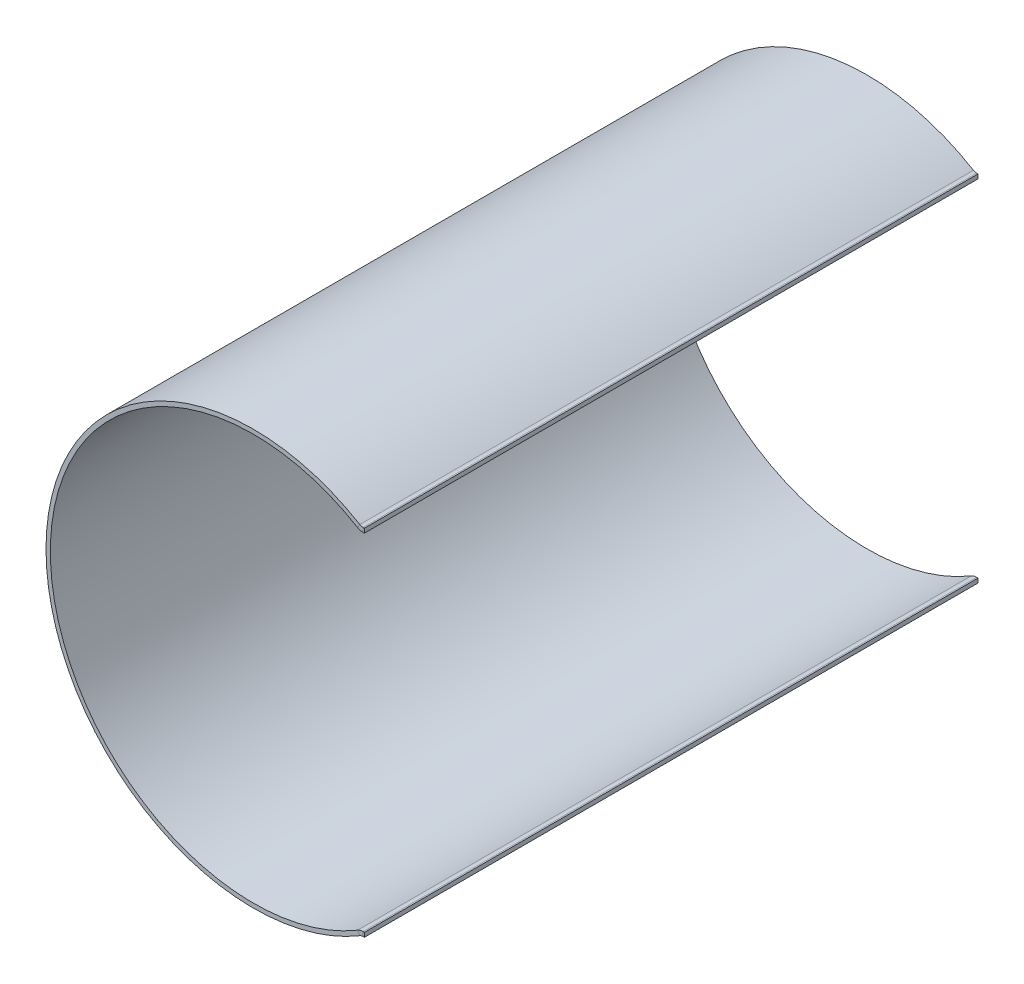
ISO-10303-21;
HEADER;
FILE_DESCRIPTION(('STEP AP214'),'2;1');
FILE_NAME('part.step','',(''),(''),'','','');
FILE_SCHEMA(('AUTOMOTIVE_DESIGN { 1 0 10303 214 1 1 1 1 }'));
ENDSEC;
DATA;
#1=APPLICATION_CONTEXT('core data for automotive mechanical design processes');
#2=APPLICATION_PROTOCOL_DEFINITION('international standard','automotive_design',2000,#1);
#3=PRODUCT_CONTEXT('',#1,'mechanical');
#4=PRODUCT('Part','Part','',(#3));
#5=PRODUCT_RELATED_PRODUCT_CATEGORY('part','',(#4));
#6=PRODUCT_DEFINITION_FORMATION('','',#4);
#7=PRODUCT_DEFINITION_CONTEXT('part definition',#1,'design');
#8=PRODUCT_DEFINITION('design','',#6,#7);
#9=PRODUCT_DEFINITION_SHAPE('','',#8);
#10=(LENGTH_UNIT() NAMED_UNIT(*) SI_UNIT(.MILLI.,.METRE.));
#11=(NAMED_UNIT(*) PLANE_ANGLE_UNIT() SI_UNIT($,.RADIAN.));
#12=(NAMED_UNIT(*) SI_UNIT($,.STERADIAN.) SOLID_ANGLE_UNIT());
#13=UNCERTAINTY_MEASURE_WITH_UNIT(LENGTH_MEASURE(1.E-05),#10,'distance_accuracy_value','');
#14=(GEOMETRIC_REPRESENTATION_CONTEXT(3) GLOBAL_UNCERTAINTY_ASSIGNED_CONTEXT((#13)) GLOBAL_UNIT_ASSIGNED_CONTEXT((#10,
#11,#12)) REPRESENTATION_CONTEXT('',''));
#15=CARTESIAN_POINT('',(0.,0.,0.));
#16=DIRECTION('',(0.,0.,1.));
#17=DIRECTION('',(1.,0.,0.));
#18=AXIS2_PLACEMENT_3D('',#15,#16,#17);
#19=CARTESIAN_POINT('',(12.0507546694725,20.1749674571283,35.5));
#20=DIRECTION('',(0.,0.,1.));
#21=DIRECTION('',(1.,0.,0.));
#22=AXIS2_PLACEMENT_3D('',#19,#20,#21);
#23=PLANE('',#22);
#24=DIRECTION('',(0.512798071041383,0.858509253494822,0.));
#25=VECTOR('',#24,1.);
#26=CARTESIAN_POINT('',(12.0507546694725,20.1749674571283,35.5));
#27=LINE('',#26,#25);
#28=CARTESIAN_POINT('',(12.0507546694725,20.1749674571283,35.5));
#29=VERTEX_POINT('',#28);
#30=CARTESIAN_POINT('',(12.3071537049932,20.6042220838757,35.5));
#31=VERTEX_POINT('',#30);
#32=EDGE_CURVE('E11',#29,#31,#27,.T.);
#33=ORIENTED_EDGE('',*,*,#32,.F.);
#34=CARTESIAN_POINT('',(12.6848807641223,21.2366,35.5));
#35=DIRECTION('',(0.,0.,1.));
#36=DIRECTION('',(1.,0.,0.));
#37=AXIS2_PLACEMENT_3D('',#34,#35,#36);
#38=CIRCLE('',#37,1.2366);
#39=CARTESIAN_POINT('',(12.6848807641223,20.,35.5));
#40=VERTEX_POINT('',#39);
#41=EDGE_CURVE('E251',#40,#29,#38,.F.);
#42=ORIENTED_EDGE('',*,*,#41,.F.);
#43=DIRECTION('',(0.,-1.,0.));
#44=VECTOR('',#43,1.);
#45=CARTESIAN_POINT('',(12.6848807641223,20.5,35.5));
#46=LINE('',#45,#44);
#47=CARTESIAN_POINT('',(12.6848807641223,20.5,35.5));
#48=VERTEX_POINT('',#47);
#49=EDGE_CURVE('E49',#48,#40,#46,.T.);
#50=ORIENTED_EDGE('',*,*,#49,.F.);
#51=CARTESIAN_POINT('',(12.6848807641223,21.2366,35.5));
#52=DIRECTION('',(0.,0.,1.));
#53=DIRECTION('',(1.,0.,0.));
#54=AXIS2_PLACEMENT_3D('',#51,#52,#53);
#55=CIRCLE('',#54,0.7366);
#56=EDGE_CURVE('E150',#48,#31,#55,.F.);
#57=ORIENTED_EDGE('',*,*,#56,.T.);
#58=EDGE_LOOP('',(#33,#42,#50,#57));
#59=FACE_BOUND('',#58,.T.);
#60=ADVANCED_FACE('F41',(#59),#23,.T.);
#61=CARTESIAN_POINT('',(12.6848807641223,20.5,35.5));
#62=DIRECTION('',(0.,0.,1.));
#63=DIRECTION('',(1.,0.,0.));
#64=AXIS2_PLACEMENT_3D('',#61,#62,#63);
#65=PLANE('',#64);
#66=CARTESIAN_POINT('',(0.,0.,35.5));
#67=DIRECTION('',(0.,0.,1.));
#68=DIRECTION('',(-1.,0.,0.));
#69=AXIS2_PLACEMENT_3D('',#66,#67,#68);
#70=CIRCLE('',#69,23.5);
#71=CARTESIAN_POINT('',(12.0507546694725,-20.1749674571283,35.5));
#72=VERTEX_POINT('',#71);
#73=EDGE_CURVE('E144',#29,#72,#70,.T.);
#74=ORIENTED_EDGE('',*,*,#73,.F.);
#75=ORIENTED_EDGE('',*,*,#32,.T.);
#76=CARTESIAN_POINT('',(0.,0.,35.5));
#77=DIRECTION('',(0.,0.,1.));
#78=DIRECTION('',(1.,0.,0.));
#79=AXIS2_PLACEMENT_3D('',#76,#77,#78);
#80=CIRCLE('',#79,24.);
#81=CARTESIAN_POINT('',(12.3071537049932,-20.6042220838757,35.5));
#82=VERTEX_POINT('',#81);
#83=EDGE_CURVE('E141',#31,#82,#80,.T.);
#84=ORIENTED_EDGE('',*,*,#83,.T.);
#85=DIRECTION('',(-0.512798071041383,0.858509253494822,0.));
#86=VECTOR('',#85,1.);
#87=CARTESIAN_POINT('',(12.3071537049932,-20.6042220838757,35.5));
#88=LINE('',#87,#86);
#89=EDGE_CURVE('E232',#82,#72,#88,.T.);
#90=ORIENTED_EDGE('',*,*,#89,.T.);
#91=EDGE_LOOP('',(#74,#75,#84,#90));
#92=FACE_BOUND('',#91,.T.);
#93=ADVANCED_FACE('F139',(#92),#65,.T.);
#94=CARTESIAN_POINT('',(12.6848807641223,20.,-35.5));
#95=DIRECTION('',(0.,0.,-1.));
#96=DIRECTION('',(-1.,0.,0.));
#97=AXIS2_PLACEMENT_3D('',#94,#95,#96);
#98=PLANE('',#97);
#99=DIRECTION('',(0.,1.,0.));
#100=VECTOR('',#99,1.);
#101=CARTESIAN_POINT('',(12.6848807641223,20.,-35.5));
#102=LINE('',#101,#100);
#103=CARTESIAN_POINT('',(12.6848807641223,20.,-35.5));
#104=VERTEX_POINT('',#103);
#105=CARTESIAN_POINT('',(12.6848807641223,20.5,-35.5));
#106=VERTEX_POINT('',#105);
#107=EDGE_CURVE('E237',#104,#106,#102,.T.);
#108=ORIENTED_EDGE('',*,*,#107,.F.);
#109=CARTESIAN_POINT('',(12.6848807641223,21.2366,-35.5));
#110=DIRECTION('',(0.,0.,1.));
#111=DIRECTION('',(1.,0.,0.));
#112=AXIS2_PLACEMENT_3D('',#109,#110,#111);
#113=CIRCLE('',#112,1.2366);
#114=CARTESIAN_POINT('',(12.0507546694725,20.1749674571283,-35.5));
#115=VERTEX_POINT('',#114);
#116=EDGE_CURVE('E189',#104,#115,#113,.F.);
#117=ORIENTED_EDGE('',*,*,#116,.T.);
#118=DIRECTION('',(-0.512798071041383,-0.858509253494822,0.));
#119=VECTOR('',#118,1.);
#120=CARTESIAN_POINT('',(12.3071537049932,20.6042220838757,-35.5));
#121=LINE('',#120,#119);
#122=CARTESIAN_POINT('',(12.3071537049932,20.6042220838757,-35.5));
#123=VERTEX_POINT('',#122);
#124=EDGE_CURVE('E235',#123,#115,#121,.T.);
#125=ORIENTED_EDGE('',*,*,#124,.F.);
#126=CARTESIAN_POINT('',(12.6848807641223,21.2366,-35.5));
#127=DIRECTION('',(0.,0.,1.));
#128=DIRECTION('',(1.,0.,0.));
#129=AXIS2_PLACEMENT_3D('',#126,#127,#128);
#130=CIRCLE('',#129,0.7366);
#131=EDGE_CURVE('E162',#106,#123,#130,.F.);
#132=ORIENTED_EDGE('',*,*,#131,.F.);
#133=EDGE_LOOP('',(#108,#117,#125,#132));
#134=FACE_BOUND('',#133,.T.);
#135=ADVANCED_FACE('F289',(#134),#98,.T.);
#136=CARTESIAN_POINT('',(12.3071537049932,20.6042220838757,-35.5));
#137=DIRECTION('',(0.,0.,-1.));
#138=DIRECTION('',(-1.,0.,0.));
#139=AXIS2_PLACEMENT_3D('',#136,#137,#138);
#140=PLANE('',#139);
#141=DIRECTION('',(-1.,0.,0.));
#142=VECTOR('',#141,1.);
#143=CARTESIAN_POINT('',(12.3389626792531,20.,-35.5));
#144=LINE('',#143,#142);
#145=CARTESIAN_POINT('',(12.8389626792531,20.,-35.5));
#146=VERTEX_POINT('',#145);
#147=EDGE_CURVE('E192',#146,#104,#144,.T.);
#148=ORIENTED_EDGE('',*,*,#147,.T.);
#149=ORIENTED_EDGE('',*,*,#107,.T.);
#150=DIRECTION('',(1.,0.,0.));
#151=VECTOR('',#150,1.);
#152=CARTESIAN_POINT('',(12.3389626792531,20.5,-35.5));
#153=LINE('',#152,#151);
#154=CARTESIAN_POINT('',(12.8389626792531,20.5,-35.5));
#155=VERTEX_POINT('',#154);
#156=EDGE_CURVE('E198',#155,#106,#153,.F.);
#157=ORIENTED_EDGE('',*,*,#156,.F.);
#158=DIRECTION('',(0.,-1.,0.));
#159=VECTOR('',#158,1.);
#160=CARTESIAN_POINT('',(12.8389626792531,20.5,-35.5));
#161=LINE('',#160,#159);
#162=EDGE_CURVE('E195',#155,#146,#161,.T.);
#163=ORIENTED_EDGE('',*,*,#162,.T.);
#164=EDGE_LOOP('',(#148,#149,#157,#163));
#165=FACE_BOUND('',#164,.T.);
#166=ADVANCED_FACE('F292',(#165),#140,.T.);
#167=CARTESIAN_POINT('',(12.6848807641223,-20.,35.5));
#168=DIRECTION('',(0.,0.,1.));
#169=DIRECTION('',(1.,0.,0.));
#170=AXIS2_PLACEMENT_3D('',#167,#168,#169);
#171=PLANE('',#170);
#172=DIRECTION('',(0.,-1.,0.));
#173=VECTOR('',#172,1.);
#174=CARTESIAN_POINT('',(12.6848807641223,-20.,35.5));
#175=LINE('',#174,#173);
#176=CARTESIAN_POINT('',(12.6848807641223,-20.,35.5));
#177=VERTEX_POINT('',#176);
#178=CARTESIAN_POINT('',(12.6848807641223,-20.5,35.5));
#179=VERTEX_POINT('',#178);
#180=EDGE_CURVE('E57',#177,#179,#175,.T.);
#181=ORIENTED_EDGE('',*,*,#180,.F.);
#182=CARTESIAN_POINT('',(12.6848807641223,-21.2366,35.5));
#183=DIRECTION('',(0.,0.,1.));
#184=DIRECTION('',(1.,0.,0.));
#185=AXIS2_PLACEMENT_3D('',#182,#183,#184);
#186=CIRCLE('',#185,1.2366);
#187=EDGE_CURVE('E261',#72,#177,#186,.F.);
#188=ORIENTED_EDGE('',*,*,#187,.F.);
#189=ORIENTED_EDGE('',*,*,#89,.F.);
#190=CARTESIAN_POINT('',(12.6848807641223,-21.2366,35.5));
#191=DIRECTION('',(0.,0.,1.));
#192=DIRECTION('',(1.,0.,0.));
#193=AXIS2_PLACEMENT_3D('',#190,#191,#192);
#194=CIRCLE('',#193,0.7366);
#195=EDGE_CURVE('E170',#82,#179,#194,.F.);
#196=ORIENTED_EDGE('',*,*,#195,.T.);
#197=EDGE_LOOP('',(#181,#188,#189,#196));
#198=FACE_BOUND('',#197,.T.);
#199=ADVANCED_FACE('F284',(#198),#171,.T.);
#200=CARTESIAN_POINT('',(12.3071537049932,-20.6042220838757,35.5));
#201=DIRECTION('',(0.,0.,1.));
#202=DIRECTION('',(1.,0.,0.));
#203=AXIS2_PLACEMENT_3D('',#200,#201,#202);
#204=PLANE('',#203);
#205=DIRECTION('',(1.,0.,0.));
#206=VECTOR('',#205,1.);
#207=CARTESIAN_POINT('',(12.3389626792531,-20.,35.5));
#208=LINE('',#207,#206);
#209=CARTESIAN_POINT('',(12.8389626792531,-20.,35.5));
#210=VERTEX_POINT('',#209);
#211=EDGE_CURVE('E264',#177,#210,#208,.T.);
#212=ORIENTED_EDGE('',*,*,#211,.F.);
#213=ORIENTED_EDGE('',*,*,#180,.T.);
#214=DIRECTION('',(1.,0.,0.));
#215=VECTOR('',#214,1.);
#216=CARTESIAN_POINT('',(12.3389626792531,-20.5,35.5));
#217=LINE('',#216,#215);
#218=CARTESIAN_POINT('',(12.838962679253,-20.5,35.5));
#219=VERTEX_POINT('',#218);
#220=EDGE_CURVE('E111',#179,#219,#217,.T.);
#221=ORIENTED_EDGE('',*,*,#220,.T.);
#222=DIRECTION('',(0.,-1.,0.));
#223=VECTOR('',#222,1.);
#224=CARTESIAN_POINT('',(12.8389626792531,-20.,35.5));
#225=LINE('',#224,#223);
#226=EDGE_CURVE('E267',#210,#219,#225,.T.);
#227=ORIENTED_EDGE('',*,*,#226,.F.);
#228=EDGE_LOOP('',(#212,#213,#221,#227));
#229=FACE_BOUND('',#228,.T.);
#230=ADVANCED_FACE('F273',(#229),#204,.T.);
#231=CARTESIAN_POINT('',(12.0507546694725,-20.1749674571283,-35.5));
#232=DIRECTION('',(0.,0.,-1.));
#233=DIRECTION('',(-1.,0.,0.));
#234=AXIS2_PLACEMENT_3D('',#231,#232,#233);
#235=PLANE('',#234);
#236=DIRECTION('',(0.512798071041383,-0.858509253494822,0.));
#237=VECTOR('',#236,1.);
#238=CARTESIAN_POINT('',(12.0507546694725,-20.1749674571283,-35.5));
#239=LINE('',#238,#237);
#240=CARTESIAN_POINT('',(12.0507546694725,-20.1749674571283,-35.5));
#241=VERTEX_POINT('',#240);
#242=CARTESIAN_POINT('',(12.3071537049932,-20.6042220838757,-35.5));
#243=VERTEX_POINT('',#242);
#244=EDGE_CURVE('E98',#241,#243,#239,.T.);
#245=ORIENTED_EDGE('',*,*,#244,.F.);
#246=CARTESIAN_POINT('',(12.6848807641223,-21.2366,-35.5));
#247=DIRECTION('',(0.,0.,1.));
#248=DIRECTION('',(1.,0.,0.));
#249=AXIS2_PLACEMENT_3D('',#246,#247,#248);
#250=CIRCLE('',#249,1.2366);
#251=CARTESIAN_POINT('',(12.6848807641223,-20.,-35.5));
#252=VERTEX_POINT('',#251);
#253=EDGE_CURVE('E185',#241,#252,#250,.F.);
#254=ORIENTED_EDGE('',*,*,#253,.T.);
#255=DIRECTION('',(0.,1.,0.));
#256=VECTOR('',#255,1.);
#257=CARTESIAN_POINT('',(12.6848807641223,-20.5,-35.5));
#258=LINE('',#257,#256);
#259=CARTESIAN_POINT('',(12.6848807641223,-20.5,-35.5));
#260=VERTEX_POINT('',#259);
#261=EDGE_CURVE('E105',#260,#252,#258,.T.);
#262=ORIENTED_EDGE('',*,*,#261,.F.);
#263=CARTESIAN_POINT('',(12.6848807641223,-21.2366,-35.5));
#264=DIRECTION('',(0.,0.,1.));
#265=DIRECTION('',(1.,0.,0.));
#266=AXIS2_PLACEMENT_3D('',#263,#264,#265);
#267=CIRCLE('',#266,0.7366);
#268=EDGE_CURVE('E204',#243,#260,#267,.F.);
#269=ORIENTED_EDGE('',*,*,#268,.F.);
#270=EDGE_LOOP('',(#245,#254,#262,#269));
#271=FACE_BOUND('',#270,.T.);
#272=ADVANCED_FACE('F321',(#271),#235,.T.);
#273=CARTESIAN_POINT('',(12.6848807641223,-20.5,-35.5));
#274=DIRECTION('',(0.,0.,-1.));
#275=DIRECTION('',(-1.,0.,0.));
#276=AXIS2_PLACEMENT_3D('',#273,#274,#275);
#277=PLANE('',#276);
#278=CARTESIAN_POINT('',(0.,0.,-35.5));
#279=DIRECTION('',(0.,0.,1.));
#280=DIRECTION('',(-1.,0.,0.));
#281=AXIS2_PLACEMENT_3D('',#278,#279,#280);
#282=CIRCLE('',#281,23.5);
#283=EDGE_CURVE('E187',#115,#241,#282,.T.);
#284=ORIENTED_EDGE('',*,*,#283,.T.);
#285=ORIENTED_EDGE('',*,*,#244,.T.);
#286=CARTESIAN_POINT('',(0.,0.,-35.5));
#287=DIRECTION('',(0.,0.,1.));
#288=DIRECTION('',(1.,0.,0.));
#289=AXIS2_PLACEMENT_3D('',#286,#287,#288);
#290=CIRCLE('',#289,24.);
#291=EDGE_CURVE('E202',#123,#243,#290,.T.);
#292=ORIENTED_EDGE('',*,*,#291,.F.);
#293=ORIENTED_EDGE('',*,*,#124,.T.);
#294=EDGE_LOOP('',(#284,#285,#292,#293));
#295=FACE_BOUND('',#294,.T.);
#296=ADVANCED_FACE('F324',(#295),#277,.T.);
#297=CARTESIAN_POINT('',(12.3389626792531,-20.5,35.5));
#298=DIRECTION('',(0.,1.,0.));
#299=DIRECTION('',(-1.,0.,0.));
#300=AXIS2_PLACEMENT_3D('',#297,#298,#299);
#301=PLANE('',#300);
#302=DIRECTION('',(1.,0.,0.));
#303=VECTOR('',#302,1.);
#304=CARTESIAN_POINT('',(12.3389626792531,-20.5,-35.5));
#305=LINE('',#304,#303);
#306=CARTESIAN_POINT('',(12.838962679253,-20.5,-35.5));
#307=VERTEX_POINT('',#306);
#308=EDGE_CURVE('E176',#260,#307,#305,.T.);
#309=ORIENTED_EDGE('',*,*,#308,.T.);
#310=DIRECTION('',(0.,0.,-1.));
#311=VECTOR('',#310,1.);
#312=CARTESIAN_POINT('',(12.838962679253,-20.5,35.5));
#313=LINE('',#312,#311);
#314=EDGE_CURVE('E228',#219,#307,#313,.T.);
#315=ORIENTED_EDGE('',*,*,#314,.F.);
#316=ORIENTED_EDGE('',*,*,#220,.F.);
#317=DIRECTION('',(0.,0.,-1.));
#318=VECTOR('',#317,1.);
#319=CARTESIAN_POINT('',(12.6848807641223,-20.5,35.5));
#320=LINE('',#319,#318);
#321=EDGE_CURVE('E172',#179,#260,#320,.T.);
#322=ORIENTED_EDGE('',*,*,#321,.T.);
#323=EDGE_LOOP('',(#309,#315,#316,#322));
#324=FACE_BOUND('',#323,.T.);
#325=ADVANCED_FACE('F327',(#324),#301,.F.);
#326=CARTESIAN_POINT('',(12.8389626792531,-20.,35.5));
#327=DIRECTION('',(1.,0.,0.));
#328=DIRECTION('',(0.,1.,0.));
#329=AXIS2_PLACEMENT_3D('',#326,#327,#328);
#330=PLANE('',#329);
#331=DIRECTION('',(0.,-1.,0.));
#332=VECTOR('',#331,1.);
#333=CARTESIAN_POINT('',(12.8389626792531,-20.,-35.5));
#334=LINE('',#333,#332);
#335=CARTESIAN_POINT('',(12.8389626792531,-20.,-35.5));
#336=VERTEX_POINT('',#335);
#337=EDGE_CURVE('E179',#336,#307,#334,.T.);
#338=ORIENTED_EDGE('',*,*,#337,.F.);
#339=DIRECTION('',(0.,0.,-1.));
#340=VECTOR('',#339,1.);
#341=CARTESIAN_POINT('',(12.8389626792531,-20.,35.5));
#342=LINE('',#341,#340);
#343=EDGE_CURVE('E226',#210,#336,#342,.T.);
#344=ORIENTED_EDGE('',*,*,#343,.F.);
#345=ORIENTED_EDGE('',*,*,#226,.T.);
#346=ORIENTED_EDGE('',*,*,#314,.T.);
#347=EDGE_LOOP('',(#338,#344,#345,#346));
#348=FACE_BOUND('',#347,.T.);
#349=ADVANCED_FACE('F272',(#348),#330,.T.);
#350=CARTESIAN_POINT('',(12.3389626792531,-20.,35.5));
#351=DIRECTION('',(0.,1.,0.));
#352=DIRECTION('',(-1.,0.,0.));
#353=AXIS2_PLACEMENT_3D('',#350,#351,#352);
#354=PLANE('',#353);
#355=DIRECTION('',(1.,0.,0.));
#356=VECTOR('',#355,1.);
#357=CARTESIAN_POINT('',(12.3389626792531,-20.,-35.5));
#358=LINE('',#357,#356);
#359=EDGE_CURVE('E182',#252,#336,#358,.T.);
#360=ORIENTED_EDGE('',*,*,#359,.F.);
#361=DIRECTION('',(0.,0.,-1.));
#362=VECTOR('',#361,1.);
#363=CARTESIAN_POINT('',(12.6848807641223,-20.,35.5));
#364=LINE('',#363,#362);
#365=EDGE_CURVE('E223',#177,#252,#364,.T.);
#366=ORIENTED_EDGE('',*,*,#365,.F.);
#367=ORIENTED_EDGE('',*,*,#211,.T.);
#368=ORIENTED_EDGE('',*,*,#343,.T.);
#369=EDGE_LOOP('',(#360,#366,#367,#368));
#370=FACE_BOUND('',#369,.T.);
#371=ADVANCED_FACE('F277',(#370),#354,.T.);
#372=CARTESIAN_POINT('',(12.6848807641223,-21.2366,35.5));
#373=DIRECTION('',(0.,0.,-1.));
#374=DIRECTION('',(-1.,0.,0.));
#375=AXIS2_PLACEMENT_3D('',#372,#373,#374);
#376=CYLINDRICAL_SURFACE('',#375,1.2366);
#377=ORIENTED_EDGE('',*,*,#253,.F.);
#378=DIRECTION('',(0.,0.,-1.));
#379=VECTOR('',#378,1.);
#380=CARTESIAN_POINT('',(12.0507546694725,-20.1749674571283,35.5));
#381=LINE('',#380,#379);
#382=EDGE_CURVE('E220',#72,#241,#381,.T.);
#383=ORIENTED_EDGE('',*,*,#382,.F.);
#384=ORIENTED_EDGE('',*,*,#187,.T.);
#385=ORIENTED_EDGE('',*,*,#365,.T.);
#386=EDGE_LOOP('',(#377,#383,#384,#385));
#387=FACE_BOUND('',#386,.T.);
#388=ADVANCED_FACE('F280',(#387),#376,.T.);
#389=CARTESIAN_POINT('',(0.,0.,35.5));
#390=DIRECTION('',(0.,0.,-1.));
#391=DIRECTION('',(-1.,0.,0.));
#392=AXIS2_PLACEMENT_3D('',#389,#390,#391);
#393=CYLINDRICAL_SURFACE('',#392,23.5);
#394=ORIENTED_EDGE('',*,*,#283,.F.);
#395=DIRECTION('',(0.,0.,-1.));
#396=VECTOR('',#395,1.);
#397=CARTESIAN_POINT('',(12.0507546694725,20.1749674571283,35.5));
#398=LINE('',#397,#396);
#399=EDGE_CURVE('E217',#29,#115,#398,.T.);
#400=ORIENTED_EDGE('',*,*,#399,.F.);
#401=ORIENTED_EDGE('',*,*,#73,.T.);
#402=ORIENTED_EDGE('',*,*,#382,.T.);
#403=EDGE_LOOP('',(#394,#400,#401,#402));
#404=FACE_BOUND('',#403,.T.);
#405=ADVANCED_FACE('F287',(#404),#393,.F.);
#406=CARTESIAN_POINT('',(12.6848807641223,21.2366,35.5));
#407=DIRECTION('',(0.,0.,-1.));
#408=DIRECTION('',(-1.,0.,0.));
#409=AXIS2_PLACEMENT_3D('',#406,#407,#408);
#410=CYLINDRICAL_SURFACE('',#409,1.2366);
#411=ORIENTED_EDGE('',*,*,#116,.F.);
#412=DIRECTION('',(0.,0.,-1.));
#413=VECTOR('',#412,1.);
#414=CARTESIAN_POINT('',(12.6848807641223,20.,35.5));
#415=LINE('',#414,#413);
#416=EDGE_CURVE('E214',#40,#104,#415,.T.);
#417=ORIENTED_EDGE('',*,*,#416,.F.);
#418=ORIENTED_EDGE('',*,*,#41,.T.);
#419=ORIENTED_EDGE('',*,*,#399,.T.);
#420=EDGE_LOOP('',(#411,#417,#418,#419));
#421=FACE_BOUND('',#420,.T.);
#422=ADVANCED_FACE('F250',(#421),#410,.T.);
#423=CARTESIAN_POINT('',(12.3389626792531,20.,35.5));
#424=DIRECTION('',(0.,-1.,0.));
#425=DIRECTION('',(0.,0.,-1.));
#426=AXIS2_PLACEMENT_3D('',#423,#424,#425);
#427=PLANE('',#426);
#428=ORIENTED_EDGE('',*,*,#147,.F.);
#429=DIRECTION('',(0.,0.,-1.));
#430=VECTOR('',#429,1.);
#431=CARTESIAN_POINT('',(12.8389626792531,20.,35.5));
#432=LINE('',#431,#430);
#433=CARTESIAN_POINT('',(12.8389626792531,20.,35.5));
#434=VERTEX_POINT('',#433);
#435=EDGE_CURVE('E212',#434,#146,#432,.T.);
#436=ORIENTED_EDGE('',*,*,#435,.F.);
#437=DIRECTION('',(-1.,0.,0.));
#438=VECTOR('',#437,1.);
#439=CARTESIAN_POINT('',(12.3389626792531,20.,35.5));
#440=LINE('',#439,#438);
#441=EDGE_CURVE('E244',#434,#40,#440,.T.);
#442=ORIENTED_EDGE('',*,*,#441,.T.);
#443=ORIENTED_EDGE('',*,*,#416,.T.);
#444=EDGE_LOOP('',(#428,#436,#442,#443));
#445=FACE_BOUND('',#444,.T.);
#446=ADVANCED_FACE('F255',(#445),#427,.T.);
#447=CARTESIAN_POINT('',(12.8389626792531,20.5,35.5));
#448=DIRECTION('',(1.,0.,0.));
#449=DIRECTION('',(0.,0.,-1.));
#450=AXIS2_PLACEMENT_3D('',#447,#448,#449);
#451=PLANE('',#450);
#452=ORIENTED_EDGE('',*,*,#162,.F.);
#453=DIRECTION('',(0.,0.,-1.));
#454=VECTOR('',#453,1.);
#455=CARTESIAN_POINT('',(12.8389626792531,20.5,35.5));
#456=LINE('',#455,#454);
#457=CARTESIAN_POINT('',(12.8389626792531,20.5,35.5));
#458=VERTEX_POINT('',#457);
#459=EDGE_CURVE('E210',#458,#155,#456,.T.);
#460=ORIENTED_EDGE('',*,*,#459,.F.);
#461=DIRECTION('',(0.,-1.,0.));
#462=VECTOR('',#461,1.);
#463=CARTESIAN_POINT('',(12.8389626792531,20.5,35.5));
#464=LINE('',#463,#462);
#465=EDGE_CURVE('E256',#458,#434,#464,.T.);
#466=ORIENTED_EDGE('',*,*,#465,.T.);
#467=ORIENTED_EDGE('',*,*,#435,.T.);
#468=EDGE_LOOP('',(#452,#460,#466,#467));
#469=FACE_BOUND('',#468,.T.);
#470=ADVANCED_FACE('F297',(#469),#451,.T.);
#471=CARTESIAN_POINT('',(12.3389626792531,20.5,35.5));
#472=DIRECTION('',(0.,-1.,0.));
#473=DIRECTION('',(0.,0.,-1.));
#474=AXIS2_PLACEMENT_3D('',#471,#472,#473);
#475=PLANE('',#474);
#476=ORIENTED_EDGE('',*,*,#156,.T.);
#477=DIRECTION('',(0.,0.,-1.));
#478=VECTOR('',#477,1.);
#479=CARTESIAN_POINT('',(12.6848807641223,20.5,35.5));
#480=LINE('',#479,#478);
#481=EDGE_CURVE('E164',#48,#106,#480,.T.);
#482=ORIENTED_EDGE('',*,*,#481,.F.);
#483=DIRECTION('',(1.,0.,0.));
#484=VECTOR('',#483,1.);
#485=CARTESIAN_POINT('',(12.3389626792531,20.5,35.5));
#486=LINE('',#485,#484);
#487=EDGE_CURVE('E155',#458,#48,#486,.F.);
#488=ORIENTED_EDGE('',*,*,#487,.F.);
#489=ORIENTED_EDGE('',*,*,#459,.T.);
#490=EDGE_LOOP('',(#476,#482,#488,#489));
#491=FACE_BOUND('',#490,.T.);
#492=ADVANCED_FACE('F295',(#491),#475,.F.);
#493=CARTESIAN_POINT('',(12.6848807641223,21.2366,35.5));
#494=DIRECTION('',(0.,0.,-1.));
#495=DIRECTION('',(-1.,0.,0.));
#496=AXIS2_PLACEMENT_3D('',#493,#494,#495);
#497=CYLINDRICAL_SURFACE('',#496,0.7366);
#498=ORIENTED_EDGE('',*,*,#131,.T.);
#499=DIRECTION('',(0.,0.,-1.));
#500=VECTOR('',#499,1.);
#501=CARTESIAN_POINT('',(12.3071537049932,20.6042220838757,35.5));
#502=LINE('',#501,#500);
#503=EDGE_CURVE('E159',#31,#123,#502,.T.);
#504=ORIENTED_EDGE('',*,*,#503,.F.);
#505=ORIENTED_EDGE('',*,*,#56,.F.);
#506=ORIENTED_EDGE('',*,*,#481,.T.);
#507=EDGE_LOOP('',(#498,#504,#505,#506));
#508=FACE_BOUND('',#507,.T.);
#509=ADVANCED_FACE('F160',(#508),#497,.F.);
#510=CARTESIAN_POINT('',(0.,0.,35.5));
#511=DIRECTION('',(0.,0.,-1.));
#512=DIRECTION('',(-1.,0.,0.));
#513=AXIS2_PLACEMENT_3D('',#510,#511,#512);
#514=CYLINDRICAL_SURFACE('',#513,24.);
#515=ORIENTED_EDGE('',*,*,#291,.T.);
#516=DIRECTION('',(0.,0.,-1.));
#517=VECTOR('',#516,1.);
#518=CARTESIAN_POINT('',(12.3071537049932,-20.6042220838757,35.5));
#519=LINE('',#518,#517);
#520=EDGE_CURVE('E165',#82,#243,#519,.T.);
#521=ORIENTED_EDGE('',*,*,#520,.F.);
#522=ORIENTED_EDGE('',*,*,#83,.F.);
#523=ORIENTED_EDGE('',*,*,#503,.T.);
#524=EDGE_LOOP('',(#515,#521,#522,#523));
#525=FACE_BOUND('',#524,.T.);
#526=ADVANCED_FACE('F167',(#525),#514,.T.);
#527=CARTESIAN_POINT('',(12.6848807641223,-21.2366,35.5));
#528=DIRECTION('',(0.,0.,-1.));
#529=DIRECTION('',(-1.,0.,0.));
#530=AXIS2_PLACEMENT_3D('',#527,#528,#529);
#531=CYLINDRICAL_SURFACE('',#530,0.7366);
#532=ORIENTED_EDGE('',*,*,#268,.T.);
#533=ORIENTED_EDGE('',*,*,#321,.F.);
#534=ORIENTED_EDGE('',*,*,#195,.F.);
#535=ORIENTED_EDGE('',*,*,#520,.T.);
#536=EDGE_LOOP('',(#532,#533,#534,#535));
#537=FACE_BOUND('',#536,.T.);
#538=ADVANCED_FACE('F379',(#537),#531,.F.);
#539=CARTESIAN_POINT('',(12.6848807641223,-21.2366,35.5));
#540=DIRECTION('',(0.,0.,1.));
#541=DIRECTION('',(1.,0.,0.));
#542=AXIS2_PLACEMENT_3D('',#539,#540,#541);
#543=PLANE('',#542);
#544=ORIENTED_EDGE('',*,*,#487,.T.);
#545=ORIENTED_EDGE('',*,*,#49,.T.);
#546=ORIENTED_EDGE('',*,*,#441,.F.);
#547=ORIENTED_EDGE('',*,*,#465,.F.);
#548=EDGE_LOOP('',(#544,#545,#546,#547));
#549=FACE_BOUND('',#548,.T.);
#550=ADVANCED_FACE('F241',(#549),#543,.T.);
#551=CARTESIAN_POINT('',(12.6848807641223,-21.2366,-35.5));
#552=DIRECTION('',(0.,0.,1.));
#553=DIRECTION('',(1.,0.,0.));
#554=AXIS2_PLACEMENT_3D('',#551,#552,#553);
#555=PLANE('',#554);
#556=ORIENTED_EDGE('',*,*,#308,.F.);
#557=ORIENTED_EDGE('',*,*,#261,.T.);
#558=ORIENTED_EDGE('',*,*,#359,.T.);
#559=ORIENTED_EDGE('',*,*,#337,.T.);
#560=EDGE_LOOP('',(#556,#557,#558,#559));
#561=FACE_BOUND('',#560,.T.);
#562=ADVANCED_FACE('F399',(#561),#555,.F.);
#563=CLOSED_SHELL('',(#60,#93,#135,#166,#199,#230,#272,#296,#325,#349,#371,#388,#405,#422,#446,
#470,#492,#509,#526,#538,#550,#562));
#564=MANIFOLD_SOLID_BREP('B2',#563);
#565=ADVANCED_BREP_SHAPE_REPRESENTATION('',(#18,#564),#14);
#566=SHAPE_DEFINITION_REPRESENTATION(#9,#565);
ENDSEC;
END-ISO-10303-21;
